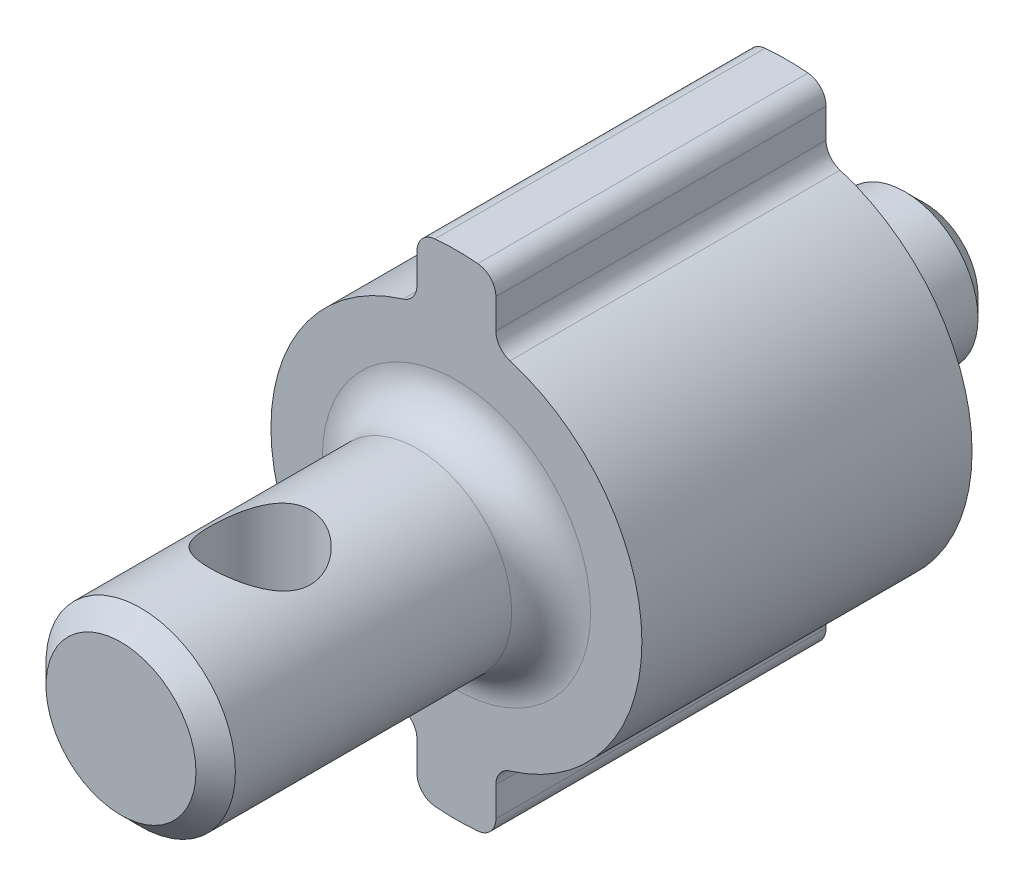
ISO-10303-21;
HEADER;
FILE_DESCRIPTION(('STEP AP214'),'2;1');
FILE_NAME('part.step','',(''),(''),'','','');
FILE_SCHEMA(('AUTOMOTIVE_DESIGN { 1 0 10303 214 1 1 1 1 }'));
ENDSEC;
DATA;
#1=APPLICATION_CONTEXT('core data for automotive mechanical design processes');
#2=APPLICATION_PROTOCOL_DEFINITION('international standard','automotive_design',2000,#1);
#3=PRODUCT_CONTEXT('',#1,'mechanical');
#4=PRODUCT('Part','Part','',(#3));
#5=PRODUCT_RELATED_PRODUCT_CATEGORY('part','',(#4));
#6=PRODUCT_DEFINITION_FORMATION('','',#4);
#7=PRODUCT_DEFINITION_CONTEXT('part definition',#1,'design');
#8=PRODUCT_DEFINITION('design','',#6,#7);
#9=PRODUCT_DEFINITION_SHAPE('','',#8);
#10=(LENGTH_UNIT() NAMED_UNIT(*) SI_UNIT(.MILLI.,.METRE.));
#11=(NAMED_UNIT(*) PLANE_ANGLE_UNIT() SI_UNIT($,.RADIAN.));
#12=(NAMED_UNIT(*) SI_UNIT($,.STERADIAN.) SOLID_ANGLE_UNIT());
#13=UNCERTAINTY_MEASURE_WITH_UNIT(LENGTH_MEASURE(1.E-05),#10,'distance_accuracy_value','');
#14=(GEOMETRIC_REPRESENTATION_CONTEXT(3) GLOBAL_UNCERTAINTY_ASSIGNED_CONTEXT((#13)) GLOBAL_UNIT_ASSIGNED_CONTEXT((#10,
#11,#12)) REPRESENTATION_CONTEXT('',''));
#15=CARTESIAN_POINT('',(0.,0.,0.));
#16=DIRECTION('',(0.,0.,1.));
#17=DIRECTION('',(1.,0.,0.));
#18=AXIS2_PLACEMENT_3D('',#15,#16,#17);
#19=CARTESIAN_POINT('',(0.,0.,11.8666666666667));
#20=DIRECTION('',(0.,0.,-1.));
#21=DIRECTION('',(-1.,0.,0.));
#22=AXIS2_PLACEMENT_3D('',#19,#20,#21);
#23=CYLINDRICAL_SURFACE('',#22,4.7);
#24=CARTESIAN_POINT('',(0.,0.,11.8666666666667));
#25=DIRECTION('',(0.,0.,1.));
#26=DIRECTION('',(1.,0.,0.));
#27=AXIS2_PLACEMENT_3D('',#24,#25,#26);
#28=CIRCLE('',#27,4.7);
#29=CARTESIAN_POINT('',(1.35576923076923,-4.50020997209013,11.8666666666667));
#30=VERTEX_POINT('',#29);
#31=CARTESIAN_POINT('',(1.35576923076923,4.50020997209013,11.8666666666667));
#32=VERTEX_POINT('',#31);
#33=EDGE_CURVE('E481',#30,#32,#28,.T.);
#34=ORIENTED_EDGE('',*,*,#33,.F.);
#35=DIRECTION('',(0.,0.,-1.));
#36=VECTOR('',#35,1.);
#37=CARTESIAN_POINT('',(1.35576923076923,-4.50020997209013,11.8666666666667));
#38=LINE('',#37,#36);
#39=CARTESIAN_POINT('',(1.35576923076923,-4.50020997209013,3.5));
#40=VERTEX_POINT('',#39);
#41=EDGE_CURVE('E256',#30,#40,#38,.T.);
#42=ORIENTED_EDGE('',*,*,#41,.T.);
#43=CARTESIAN_POINT('',(0.,0.,3.5));
#44=DIRECTION('',(0.,0.,-1.));
#45=DIRECTION('',(-1.,0.,0.));
#46=AXIS2_PLACEMENT_3D('',#43,#44,#45);
#47=CIRCLE('',#46,4.7);
#48=CARTESIAN_POINT('',(1.35576923076923,4.50020997209013,3.5));
#49=VERTEX_POINT('',#48);
#50=EDGE_CURVE('E198',#49,#40,#47,.T.);
#51=ORIENTED_EDGE('',*,*,#50,.F.);
#52=DIRECTION('',(0.,0.,-1.));
#53=VECTOR('',#52,1.);
#54=CARTESIAN_POINT('',(1.35576923076923,4.50020997209013,11.8666666666667));
#55=LINE('',#54,#53);
#56=EDGE_CURVE('E252',#49,#32,#55,.F.);
#57=ORIENTED_EDGE('',*,*,#56,.T.);
#58=EDGE_LOOP('',(#34,#42,#51,#57));
#59=FACE_BOUND('',#58,.T.);
#60=ADVANCED_FACE('F50',(#59),#23,.T.);
#61=CARTESIAN_POINT('',(-1.35576923076923,-4.50020997209013,3.5));
#62=VERTEX_POINT('',#61);
#63=CARTESIAN_POINT('',(-1.35576923076923,4.50020997209013,3.5));
#64=VERTEX_POINT('',#63);
#65=EDGE_CURVE('E178',#62,#64,#47,.T.);
#66=ORIENTED_EDGE('',*,*,#65,.F.);
#67=DIRECTION('',(0.,0.,-1.));
#68=VECTOR('',#67,1.);
#69=CARTESIAN_POINT('',(-1.35576923076923,-4.50020997209013,11.8666666666667));
#70=LINE('',#69,#68);
#71=CARTESIAN_POINT('',(-1.35576923076923,-4.50020997209013,11.8666666666667));
#72=VERTEX_POINT('',#71);
#73=EDGE_CURVE('E193',#62,#72,#70,.F.);
#74=ORIENTED_EDGE('',*,*,#73,.T.);
#75=CARTESIAN_POINT('',(-1.35576923076923,4.50020997209013,11.8666666666667));
#76=VERTEX_POINT('',#75);
#77=EDGE_CURVE('E210',#76,#72,#28,.T.);
#78=ORIENTED_EDGE('',*,*,#77,.F.);
#79=DIRECTION('',(0.,0.,-1.));
#80=VECTOR('',#79,1.);
#81=CARTESIAN_POINT('',(-1.35576923076923,4.50020997209013,11.8666666666667));
#82=LINE('',#81,#80);
#83=EDGE_CURVE('E196',#76,#64,#82,.T.);
#84=ORIENTED_EDGE('',*,*,#83,.T.);
#85=EDGE_LOOP('',(#66,#74,#78,#84));
#86=FACE_BOUND('',#85,.T.);
#87=ADVANCED_FACE('F191',(#86),#23,.T.);
#88=CARTESIAN_POINT('',(0.,0.,11.8666666666667));
#89=DIRECTION('',(0.,0.,1.));
#90=DIRECTION('',(1.,0.,0.));
#91=AXIS2_PLACEMENT_3D('',#88,#89,#90);
#92=PLANE('',#91);
#93=CARTESIAN_POINT('',(0.,0.,11.8666666666667));
#94=DIRECTION('',(0.,0.,1.));
#95=DIRECTION('',(1.,0.,0.));
#96=AXIS2_PLACEMENT_3D('',#93,#94,#95);
#97=CIRCLE('',#96,3.4);
#98=CARTESIAN_POINT('',(3.4,0.,11.8666666666667));
#99=VERTEX_POINT('',#98);
#100=EDGE_CURVE('E310',#99,#99,#97,.F.);
#101=ORIENTED_EDGE('',*,*,#100,.T.);
#102=EDGE_LOOP('',(#101));
#103=FACE_BOUND('',#102,.T.);
#104=DIRECTION('',(0.,-1.,0.));
#105=VECTOR('',#104,1.);
#106=CARTESIAN_POINT('',(-0.999999999999999,0.,11.8666666666667));
#107=LINE('',#106,#105);
#108=CARTESIAN_POINT('',(-1.,-4.97895571380184,11.8666666666667));
#109=VERTEX_POINT('',#108);
#110=CARTESIAN_POINT('',(-1.,-5.7282196186948,11.8666666666667));
#111=VERTEX_POINT('',#110);
#112=EDGE_CURVE('E437',#109,#111,#107,.T.);
#113=ORIENTED_EDGE('',*,*,#112,.T.);
#114=CARTESIAN_POINT('',(-0.5,-5.7282196186948,11.8666666666667));
#115=DIRECTION('',(0.,0.,1.));
#116=DIRECTION('',(1.,0.,0.));
#117=AXIS2_PLACEMENT_3D('',#114,#115,#116);
#118=CIRCLE('',#117,0.5);
#119=CARTESIAN_POINT('',(-0.543478260869565,-6.22632567249435,11.8666666666667));
#120=VERTEX_POINT('',#119);
#121=EDGE_CURVE('E224',#111,#120,#118,.T.);
#122=ORIENTED_EDGE('',*,*,#121,.T.);
#123=CARTESIAN_POINT('',(0.,0.,11.8666666666667));
#124=DIRECTION('',(0.,0.,1.));
#125=DIRECTION('',(1.,0.,0.));
#126=AXIS2_PLACEMENT_3D('',#123,#124,#125);
#127=CIRCLE('',#126,6.25);
#128=CARTESIAN_POINT('',(0.543478260869566,-6.22632567249435,11.8666666666667));
#129=VERTEX_POINT('',#128);
#130=EDGE_CURVE('E442',#120,#129,#127,.T.);
#131=ORIENTED_EDGE('',*,*,#130,.T.);
#132=CARTESIAN_POINT('',(0.5,-5.7282196186948,11.8666666666667));
#133=DIRECTION('',(0.,0.,1.));
#134=DIRECTION('',(1.,0.,0.));
#135=AXIS2_PLACEMENT_3D('',#132,#133,#134);
#136=CIRCLE('',#135,0.5);
#137=CARTESIAN_POINT('',(1.,-5.7282196186948,11.8666666666667));
#138=VERTEX_POINT('',#137);
#139=EDGE_CURVE('E221',#129,#138,#136,.T.);
#140=ORIENTED_EDGE('',*,*,#139,.T.);
#141=DIRECTION('',(0.,-1.,0.));
#142=VECTOR('',#141,1.);
#143=CARTESIAN_POINT('',(1.,0.,11.8666666666667));
#144=LINE('',#143,#142);
#145=CARTESIAN_POINT('',(1.,-4.97895571380184,11.8666666666667));
#146=VERTEX_POINT('',#145);
#147=EDGE_CURVE('E456',#146,#138,#144,.T.);
#148=ORIENTED_EDGE('',*,*,#147,.F.);
#149=CARTESIAN_POINT('',(1.5,-4.97895571380184,11.8666666666667));
#150=DIRECTION('',(0.,0.,1.));
#151=DIRECTION('',(1.,0.,0.));
#152=AXIS2_PLACEMENT_3D('',#149,#150,#151);
#153=CIRCLE('',#152,0.5);
#154=EDGE_CURVE('E186',#146,#30,#153,.F.);
#155=ORIENTED_EDGE('',*,*,#154,.T.);
#156=ORIENTED_EDGE('',*,*,#33,.T.);
#157=CARTESIAN_POINT('',(1.5,4.97895571380184,11.8666666666667));
#158=DIRECTION('',(0.,0.,1.));
#159=DIRECTION('',(1.,0.,0.));
#160=AXIS2_PLACEMENT_3D('',#157,#158,#159);
#161=CIRCLE('',#160,0.5);
#162=CARTESIAN_POINT('',(1.,4.97895571380184,11.8666666666667));
#163=VERTEX_POINT('',#162);
#164=EDGE_CURVE('E292',#32,#163,#161,.F.);
#165=ORIENTED_EDGE('',*,*,#164,.T.);
#166=DIRECTION('',(0.,1.,0.));
#167=VECTOR('',#166,1.);
#168=CARTESIAN_POINT('',(1.,0.,11.8666666666667));
#169=LINE('',#168,#167);
#170=CARTESIAN_POINT('',(1.,5.7282196186948,11.8666666666667));
#171=VERTEX_POINT('',#170);
#172=EDGE_CURVE('E469',#163,#171,#169,.T.);
#173=ORIENTED_EDGE('',*,*,#172,.T.);
#174=CARTESIAN_POINT('',(0.5,5.7282196186948,11.8666666666667));
#175=DIRECTION('',(0.,0.,1.));
#176=DIRECTION('',(1.,0.,0.));
#177=AXIS2_PLACEMENT_3D('',#174,#175,#176);
#178=CIRCLE('',#177,0.5);
#179=CARTESIAN_POINT('',(0.543478260869566,6.22632567249435,11.8666666666667));
#180=VERTEX_POINT('',#179);
#181=EDGE_CURVE('E218',#171,#180,#178,.T.);
#182=ORIENTED_EDGE('',*,*,#181,.T.);
#183=CARTESIAN_POINT('',(0.,0.,11.8666666666667));
#184=DIRECTION('',(0.,0.,1.));
#185=DIRECTION('',(1.,0.,0.));
#186=AXIS2_PLACEMENT_3D('',#183,#184,#185);
#187=CIRCLE('',#186,6.25);
#188=CARTESIAN_POINT('',(-0.543478260869565,6.22632567249435,11.8666666666667));
#189=VERTEX_POINT('',#188);
#190=EDGE_CURVE('E465',#180,#189,#187,.T.);
#191=ORIENTED_EDGE('',*,*,#190,.T.);
#192=CARTESIAN_POINT('',(-0.5,5.7282196186948,11.8666666666667));
#193=DIRECTION('',(0.,0.,1.));
#194=DIRECTION('',(1.,0.,0.));
#195=AXIS2_PLACEMENT_3D('',#192,#193,#194);
#196=CIRCLE('',#195,0.5);
#197=CARTESIAN_POINT('',(-1.,5.7282196186948,11.8666666666667));
#198=VERTEX_POINT('',#197);
#199=EDGE_CURVE('E215',#189,#198,#196,.T.);
#200=ORIENTED_EDGE('',*,*,#199,.T.);
#201=DIRECTION('',(0.,1.,0.));
#202=VECTOR('',#201,1.);
#203=CARTESIAN_POINT('',(-0.999999999999999,0.,11.8666666666667));
#204=LINE('',#203,#202);
#205=CARTESIAN_POINT('',(-1.,4.97895571380184,11.8666666666667));
#206=VERTEX_POINT('',#205);
#207=EDGE_CURVE('E460',#206,#198,#204,.T.);
#208=ORIENTED_EDGE('',*,*,#207,.F.);
#209=CARTESIAN_POINT('',(-1.5,4.97895571380184,11.8666666666667));
#210=DIRECTION('',(0.,0.,1.));
#211=DIRECTION('',(1.,0.,0.));
#212=AXIS2_PLACEMENT_3D('',#209,#210,#211);
#213=CIRCLE('',#212,0.5);
#214=EDGE_CURVE('E286',#206,#76,#213,.F.);
#215=ORIENTED_EDGE('',*,*,#214,.T.);
#216=ORIENTED_EDGE('',*,*,#77,.T.);
#217=CARTESIAN_POINT('',(-1.5,-4.97895571380184,11.8666666666667));
#218=DIRECTION('',(0.,0.,1.));
#219=DIRECTION('',(1.,0.,0.));
#220=AXIS2_PLACEMENT_3D('',#217,#218,#219);
#221=CIRCLE('',#220,0.5);
#222=EDGE_CURVE('E187',#72,#109,#221,.F.);
#223=ORIENTED_EDGE('',*,*,#222,.T.);
#224=EDGE_LOOP('',(#113,#122,#131,#140,#148,#155,#156,#165,#173,#182,#191,#200,#208,#215,#216,#223));
#225=FACE_BOUND('',#224,.T.);
#226=ADVANCED_FACE('F360',(#103,#225),#92,.T.);
#227=CARTESIAN_POINT('',(0.,0.,3.5));
#228=DIRECTION('',(0.,0.,-1.));
#229=DIRECTION('',(-1.,0.,0.));
#230=AXIS2_PLACEMENT_3D('',#227,#228,#229);
#231=PLANE('',#230);
#232=CARTESIAN_POINT('',(0.,0.,3.5));
#233=DIRECTION('',(0.,0.,-1.));
#234=DIRECTION('',(-1.,0.,0.));
#235=AXIS2_PLACEMENT_3D('',#232,#233,#234);
#236=CIRCLE('',#235,2.35);
#237=CARTESIAN_POINT('',(-2.35,0.,3.5));
#238=VERTEX_POINT('',#237);
#239=EDGE_CURVE('E302',#238,#238,#236,.F.);
#240=ORIENTED_EDGE('',*,*,#239,.T.);
#241=EDGE_LOOP('',(#240));
#242=FACE_BOUND('',#241,.T.);
#243=CARTESIAN_POINT('',(0.,0.,3.5));
#244=DIRECTION('',(0.,0.,-1.));
#245=DIRECTION('',(-1.,0.,0.));
#246=AXIS2_PLACEMENT_3D('',#243,#244,#245);
#247=CIRCLE('',#246,6.25);
#248=CARTESIAN_POINT('',(-0.543478260869565,-6.22632567249435,3.5));
#249=VERTEX_POINT('',#248);
#250=CARTESIAN_POINT('',(0.543478260869566,-6.22632567249435,3.5));
#251=VERTEX_POINT('',#250);
#252=EDGE_CURVE('E447',#249,#251,#247,.F.);
#253=ORIENTED_EDGE('',*,*,#252,.F.);
#254=CARTESIAN_POINT('',(-0.5,-5.7282196186948,3.5));
#255=DIRECTION('',(0.,0.,-1.));
#256=DIRECTION('',(-1.,0.,0.));
#257=AXIS2_PLACEMENT_3D('',#254,#255,#256);
#258=CIRCLE('',#257,0.5);
#259=CARTESIAN_POINT('',(-1.,-5.7282196186948,3.5));
#260=VERTEX_POINT('',#259);
#261=EDGE_CURVE('E242',#249,#260,#258,.T.);
#262=ORIENTED_EDGE('',*,*,#261,.T.);
#263=DIRECTION('',(0.,-1.,0.));
#264=VECTOR('',#263,1.);
#265=CARTESIAN_POINT('',(-0.999999999999999,0.,3.5));
#266=LINE('',#265,#264);
#267=CARTESIAN_POINT('',(-1.,-4.97895571380184,3.5));
#268=VERTEX_POINT('',#267);
#269=EDGE_CURVE('E181',#268,#260,#266,.T.);
#270=ORIENTED_EDGE('',*,*,#269,.F.);
#271=CARTESIAN_POINT('',(-1.5,-4.97895571380184,3.5));
#272=DIRECTION('',(0.,0.,-1.));
#273=DIRECTION('',(-1.,0.,0.));
#274=AXIS2_PLACEMENT_3D('',#271,#272,#273);
#275=CIRCLE('',#274,0.5);
#276=EDGE_CURVE('E174',#268,#62,#275,.F.);
#277=ORIENTED_EDGE('',*,*,#276,.T.);
#278=ORIENTED_EDGE('',*,*,#65,.T.);
#279=CARTESIAN_POINT('',(-1.5,4.97895571380184,3.5));
#280=DIRECTION('',(0.,0.,-1.));
#281=DIRECTION('',(-1.,0.,0.));
#282=AXIS2_PLACEMENT_3D('',#279,#280,#281);
#283=CIRCLE('',#282,0.5);
#284=CARTESIAN_POINT('',(-1.,4.97895571380184,3.5));
#285=VERTEX_POINT('',#284);
#286=EDGE_CURVE('E289',#64,#285,#283,.F.);
#287=ORIENTED_EDGE('',*,*,#286,.T.);
#288=DIRECTION('',(0.,1.,0.));
#289=VECTOR('',#288,1.);
#290=CARTESIAN_POINT('',(-0.999999999999999,0.,3.5));
#291=LINE('',#290,#289);
#292=CARTESIAN_POINT('',(-1.,5.7282196186948,3.5));
#293=VERTEX_POINT('',#292);
#294=EDGE_CURVE('E458',#285,#293,#291,.T.);
#295=ORIENTED_EDGE('',*,*,#294,.T.);
#296=CARTESIAN_POINT('',(-0.5,5.7282196186948,3.5));
#297=DIRECTION('',(0.,0.,-1.));
#298=DIRECTION('',(-1.,0.,0.));
#299=AXIS2_PLACEMENT_3D('',#296,#297,#298);
#300=CIRCLE('',#299,0.5);
#301=CARTESIAN_POINT('',(-0.543478260869565,6.22632567249435,3.5));
#302=VERTEX_POINT('',#301);
#303=EDGE_CURVE('E234',#293,#302,#300,.T.);
#304=ORIENTED_EDGE('',*,*,#303,.T.);
#305=CARTESIAN_POINT('',(0.,0.,3.5));
#306=DIRECTION('',(0.,0.,-1.));
#307=DIRECTION('',(-1.,0.,0.));
#308=AXIS2_PLACEMENT_3D('',#305,#306,#307);
#309=CIRCLE('',#308,6.25);
#310=CARTESIAN_POINT('',(0.543478260869566,6.22632567249435,3.5));
#311=VERTEX_POINT('',#310);
#312=EDGE_CURVE('E464',#311,#302,#309,.F.);
#313=ORIENTED_EDGE('',*,*,#312,.F.);
#314=CARTESIAN_POINT('',(0.5,5.7282196186948,3.5));
#315=DIRECTION('',(0.,0.,-1.));
#316=DIRECTION('',(-1.,0.,0.));
#317=AXIS2_PLACEMENT_3D('',#314,#315,#316);
#318=CIRCLE('',#317,0.5);
#319=CARTESIAN_POINT('',(1.,5.7282196186948,3.5));
#320=VERTEX_POINT('',#319);
#321=EDGE_CURVE('E74',#311,#320,#318,.T.);
#322=ORIENTED_EDGE('',*,*,#321,.T.);
#323=DIRECTION('',(0.,1.,0.));
#324=VECTOR('',#323,1.);
#325=CARTESIAN_POINT('',(1.,0.,3.5));
#326=LINE('',#325,#324);
#327=CARTESIAN_POINT('',(1.,4.97895571380184,3.5));
#328=VERTEX_POINT('',#327);
#329=EDGE_CURVE('E199',#328,#320,#326,.T.);
#330=ORIENTED_EDGE('',*,*,#329,.F.);
#331=CARTESIAN_POINT('',(1.5,4.97895571380184,3.5));
#332=DIRECTION('',(0.,0.,-1.));
#333=DIRECTION('',(-1.,0.,0.));
#334=AXIS2_PLACEMENT_3D('',#331,#332,#333);
#335=CIRCLE('',#334,0.5);
#336=EDGE_CURVE('E295',#328,#49,#335,.F.);
#337=ORIENTED_EDGE('',*,*,#336,.T.);
#338=ORIENTED_EDGE('',*,*,#50,.T.);
#339=CARTESIAN_POINT('',(1.5,-4.97895571380184,3.5));
#340=DIRECTION('',(0.,0.,-1.));
#341=DIRECTION('',(-1.,0.,0.));
#342=AXIS2_PLACEMENT_3D('',#339,#340,#341);
#343=CIRCLE('',#342,0.5);
#344=CARTESIAN_POINT('',(1.,-4.97895571380184,3.5));
#345=VERTEX_POINT('',#344);
#346=EDGE_CURVE('E283',#40,#345,#343,.F.);
#347=ORIENTED_EDGE('',*,*,#346,.T.);
#348=DIRECTION('',(0.,-1.,0.));
#349=VECTOR('',#348,1.);
#350=CARTESIAN_POINT('',(1.,0.,3.5));
#351=LINE('',#350,#349);
#352=CARTESIAN_POINT('',(1.,-5.7282196186948,3.5));
#353=VERTEX_POINT('',#352);
#354=EDGE_CURVE('E443',#345,#353,#351,.T.);
#355=ORIENTED_EDGE('',*,*,#354,.T.);
#356=CARTESIAN_POINT('',(0.5,-5.7282196186948,3.5));
#357=DIRECTION('',(0.,0.,-1.));
#358=DIRECTION('',(-1.,0.,0.));
#359=AXIS2_PLACEMENT_3D('',#356,#357,#358);
#360=CIRCLE('',#359,0.5);
#361=EDGE_CURVE('E239',#353,#251,#360,.T.);
#362=ORIENTED_EDGE('',*,*,#361,.T.);
#363=EDGE_LOOP('',(#253,#262,#270,#277,#278,#287,#295,#304,#313,#322,#330,#337,#338,#347,#355,#362));
#364=FACE_BOUND('',#363,.T.);
#365=ADVANCED_FACE('F177',(#242,#364),#231,.T.);
#366=CARTESIAN_POINT('',(0.,0.,3.5));
#367=DIRECTION('',(0.,0.,-1.));
#368=DIRECTION('',(-1.,0.,0.));
#369=AXIS2_PLACEMENT_3D('',#366,#367,#368);
#370=CYLINDRICAL_SURFACE('',#369,1.85);
#371=CARTESIAN_POINT('',(0.,0.,0.500000000000003));
#372=DIRECTION('',(0.,0.,1.));
#373=DIRECTION('',(1.,0.,0.));
#374=AXIS2_PLACEMENT_3D('',#371,#372,#373);
#375=CIRCLE('',#374,1.85);
#376=CARTESIAN_POINT('',(1.85,0.,0.500000000000003));
#377=VERTEX_POINT('',#376);
#378=EDGE_CURVE('E318',#377,#377,#375,.T.);
#379=ORIENTED_EDGE('',*,*,#378,.T.);
#380=EDGE_LOOP('',(#379));
#381=FACE_BOUND('',#380,.T.);
#382=CARTESIAN_POINT('',(0.,0.,3.));
#383=DIRECTION('',(0.,0.,-1.));
#384=DIRECTION('',(-1.,0.,0.));
#385=AXIS2_PLACEMENT_3D('',#382,#383,#384);
#386=CIRCLE('',#385,1.85);
#387=CARTESIAN_POINT('',(-1.85,0.,3.));
#388=VERTEX_POINT('',#387);
#389=EDGE_CURVE('E298',#388,#388,#386,.T.);
#390=ORIENTED_EDGE('',*,*,#389,.T.);
#391=EDGE_LOOP('',(#390));
#392=FACE_BOUND('',#391,.T.);
#393=ADVANCED_FACE('F412',(#381,#392),#370,.T.);
#394=CARTESIAN_POINT('',(0.,0.,0.));
#395=DIRECTION('',(0.,0.,1.));
#396=DIRECTION('',(1.,0.,0.));
#397=AXIS2_PLACEMENT_3D('',#394,#395,#396);
#398=PLANE('',#397);
#399=CARTESIAN_POINT('',(0.,0.,0.));
#400=DIRECTION('',(0.,0.,1.));
#401=DIRECTION('',(1.,0.,0.));
#402=AXIS2_PLACEMENT_3D('',#399,#400,#401);
#403=CIRCLE('',#402,1.35);
#404=CARTESIAN_POINT('',(1.35,0.,0.));
#405=VERTEX_POINT('',#404);
#406=EDGE_CURVE('E314',#405,#405,#403,.F.);
#407=ORIENTED_EDGE('',*,*,#406,.T.);
#408=EDGE_LOOP('',(#407));
#409=FACE_BOUND('',#408,.T.);
#410=ADVANCED_FACE('F364',(#409),#398,.F.);
#411=CARTESIAN_POINT('',(0.,0.,0.90236887068721));
#412=DIRECTION('',(0.,0.,1.));
#413=DIRECTION('',(1.,0.,0.));
#414=AXIS2_PLACEMENT_3D('',#411,#412,#413);
#415=CYLINDRICAL_SURFACE('',#414,6.25);
#416=ORIENTED_EDGE('',*,*,#190,.F.);
#417=DIRECTION('',(0.,0.,1.));
#418=VECTOR('',#417,1.);
#419=CARTESIAN_POINT('',(0.543478260869566,6.22632567249435,0.90236887068721));
#420=LINE('',#419,#418);
#421=EDGE_CURVE('E269',#180,#311,#420,.F.);
#422=ORIENTED_EDGE('',*,*,#421,.T.);
#423=ORIENTED_EDGE('',*,*,#312,.T.);
#424=DIRECTION('',(0.,0.,1.));
#425=VECTOR('',#424,1.);
#426=CARTESIAN_POINT('',(-0.543478260869565,6.22632567249435,0.90236887068721));
#427=LINE('',#426,#425);
#428=EDGE_CURVE('E265',#302,#189,#427,.T.);
#429=ORIENTED_EDGE('',*,*,#428,.T.);
#430=EDGE_LOOP('',(#416,#422,#423,#429));
#431=FACE_BOUND('',#430,.T.);
#432=ADVANCED_FACE('F411',(#431),#415,.T.);
#433=CARTESIAN_POINT('',(-0.999999999999999,0.,0.90236887068721));
#434=DIRECTION('',(1.,0.,0.));
#435=DIRECTION('',(0.,1.,0.));
#436=AXIS2_PLACEMENT_3D('',#433,#434,#435);
#437=PLANE('',#436);
#438=ORIENTED_EDGE('',*,*,#207,.T.);
#439=DIRECTION('',(0.,0.,-1.));
#440=VECTOR('',#439,1.);
#441=CARTESIAN_POINT('',(-1.,5.7282196186948,3.5));
#442=LINE('',#441,#440);
#443=EDGE_CURVE('E276',#198,#293,#442,.T.);
#444=ORIENTED_EDGE('',*,*,#443,.T.);
#445=ORIENTED_EDGE('',*,*,#294,.F.);
#446=DIRECTION('',(0.,0.,1.));
#447=VECTOR('',#446,1.);
#448=CARTESIAN_POINT('',(-1.,4.97895571380184,11.8666666666667));
#449=LINE('',#448,#447);
#450=EDGE_CURVE('E272',#285,#206,#449,.T.);
#451=ORIENTED_EDGE('',*,*,#450,.T.);
#452=EDGE_LOOP('',(#438,#444,#445,#451));
#453=FACE_BOUND('',#452,.T.);
#454=ADVANCED_FACE('F417',(#453),#437,.F.);
#455=CARTESIAN_POINT('',(1.,0.,0.90236887068721));
#456=DIRECTION('',(1.,0.,0.));
#457=DIRECTION('',(0.,1.,0.));
#458=AXIS2_PLACEMENT_3D('',#455,#456,#457);
#459=PLANE('',#458);
#460=ORIENTED_EDGE('',*,*,#329,.T.);
#461=DIRECTION('',(0.,0.,1.));
#462=VECTOR('',#461,1.);
#463=CARTESIAN_POINT('',(1.,5.7282196186948,0.90236887068721));
#464=LINE('',#463,#462);
#465=EDGE_CURVE('E261',#320,#171,#464,.T.);
#466=ORIENTED_EDGE('',*,*,#465,.T.);
#467=ORIENTED_EDGE('',*,*,#172,.F.);
#468=DIRECTION('',(0.,0.,-1.));
#469=VECTOR('',#468,1.);
#470=CARTESIAN_POINT('',(1.,4.97895571380184,0.90236887068721));
#471=LINE('',#470,#469);
#472=EDGE_CURVE('E81',#163,#328,#471,.T.);
#473=ORIENTED_EDGE('',*,*,#472,.T.);
#474=EDGE_LOOP('',(#460,#466,#467,#473));
#475=FACE_BOUND('',#474,.T.);
#476=ADVANCED_FACE('F514',(#475),#459,.T.);
#477=CARTESIAN_POINT('',(0.,0.,0.90236887068721));
#478=DIRECTION('',(0.,0.,1.));
#479=DIRECTION('',(1.,0.,0.));
#480=AXIS2_PLACEMENT_3D('',#477,#478,#479);
#481=CYLINDRICAL_SURFACE('',#480,6.25);
#482=ORIENTED_EDGE('',*,*,#130,.F.);
#483=DIRECTION('',(0.,0.,1.));
#484=VECTOR('',#483,1.);
#485=CARTESIAN_POINT('',(-0.543478260869565,-6.22632567249435,0.90236887068721));
#486=LINE('',#485,#484);
#487=EDGE_CURVE('E231',#120,#249,#486,.F.);
#488=ORIENTED_EDGE('',*,*,#487,.T.);
#489=ORIENTED_EDGE('',*,*,#252,.T.);
#490=DIRECTION('',(0.,0.,1.));
#491=VECTOR('',#490,1.);
#492=CARTESIAN_POINT('',(0.543478260869566,-6.22632567249435,0.90236887068721));
#493=LINE('',#492,#491);
#494=EDGE_CURVE('E227',#251,#129,#493,.T.);
#495=ORIENTED_EDGE('',*,*,#494,.T.);
#496=EDGE_LOOP('',(#482,#488,#489,#495));
#497=FACE_BOUND('',#496,.T.);
#498=ADVANCED_FACE('F502',(#497),#481,.T.);
#499=CARTESIAN_POINT('',(1.,0.,0.90236887068721));
#500=DIRECTION('',(-1.,0.,0.));
#501=DIRECTION('',(0.,-1.,0.));
#502=AXIS2_PLACEMENT_3D('',#499,#500,#501);
#503=PLANE('',#502);
#504=ORIENTED_EDGE('',*,*,#354,.F.);
#505=DIRECTION('',(0.,0.,1.));
#506=VECTOR('',#505,1.);
#507=CARTESIAN_POINT('',(1.,-4.97895571380184,11.8666666666667));
#508=LINE('',#507,#506);
#509=EDGE_CURVE('E248',#345,#146,#508,.T.);
#510=ORIENTED_EDGE('',*,*,#509,.T.);
#511=ORIENTED_EDGE('',*,*,#147,.T.);
#512=DIRECTION('',(0.,0.,-1.));
#513=VECTOR('',#512,1.);
#514=CARTESIAN_POINT('',(1.,-5.7282196186948,3.5));
#515=LINE('',#514,#513);
#516=EDGE_CURVE('E245',#138,#353,#515,.T.);
#517=ORIENTED_EDGE('',*,*,#516,.T.);
#518=EDGE_LOOP('',(#504,#510,#511,#517));
#519=FACE_BOUND('',#518,.T.);
#520=ADVANCED_FACE('F496',(#519),#503,.F.);
#521=CARTESIAN_POINT('',(-0.999999999999999,0.,0.90236887068721));
#522=DIRECTION('',(-1.,0.,0.));
#523=DIRECTION('',(0.,-1.,0.));
#524=AXIS2_PLACEMENT_3D('',#521,#522,#523);
#525=PLANE('',#524);
#526=ORIENTED_EDGE('',*,*,#112,.F.);
#527=DIRECTION('',(0.,0.,-1.));
#528=VECTOR('',#527,1.);
#529=CARTESIAN_POINT('',(-1.,-4.97895571380184,0.90236887068721));
#530=LINE('',#529,#528);
#531=EDGE_CURVE('E208',#109,#268,#530,.T.);
#532=ORIENTED_EDGE('',*,*,#531,.T.);
#533=ORIENTED_EDGE('',*,*,#269,.T.);
#534=DIRECTION('',(0.,0.,1.));
#535=VECTOR('',#534,1.);
#536=CARTESIAN_POINT('',(-1.,-5.7282196186948,0.90236887068721));
#537=LINE('',#536,#535);
#538=EDGE_CURVE('E203',#260,#111,#537,.T.);
#539=ORIENTED_EDGE('',*,*,#538,.T.);
#540=EDGE_LOOP('',(#526,#532,#533,#539));
#541=FACE_BOUND('',#540,.T.);
#542=ADVANCED_FACE('F369',(#541),#525,.T.);
#543=CARTESIAN_POINT('',(-1.5,-4.97895571380184,11.8666666666667));
#544=DIRECTION('',(0.,0.,-1.));
#545=DIRECTION('',(-1.,0.,0.));
#546=AXIS2_PLACEMENT_3D('',#543,#544,#545);
#547=CYLINDRICAL_SURFACE('',#546,0.5);
#548=ORIENTED_EDGE('',*,*,#276,.F.);
#549=ORIENTED_EDGE('',*,*,#531,.F.);
#550=ORIENTED_EDGE('',*,*,#222,.F.);
#551=ORIENTED_EDGE('',*,*,#73,.F.);
#552=EDGE_LOOP('',(#548,#549,#550,#551));
#553=FACE_BOUND('',#552,.T.);
#554=ADVANCED_FACE('F201',(#553),#547,.F.);
#555=CARTESIAN_POINT('',(-0.5,-5.7282196186948,0.90236887068721));
#556=DIRECTION('',(0.,0.,1.));
#557=DIRECTION('',(1.,0.,0.));
#558=AXIS2_PLACEMENT_3D('',#555,#556,#557);
#559=CYLINDRICAL_SURFACE('',#558,0.5);
#560=ORIENTED_EDGE('',*,*,#261,.F.);
#561=ORIENTED_EDGE('',*,*,#487,.F.);
#562=ORIENTED_EDGE('',*,*,#121,.F.);
#563=ORIENTED_EDGE('',*,*,#538,.F.);
#564=EDGE_LOOP('',(#560,#561,#562,#563));
#565=FACE_BOUND('',#564,.T.);
#566=ADVANCED_FACE('F368',(#565),#559,.T.);
#567=CARTESIAN_POINT('',(1.5,-4.97895571380184,11.8666666666667));
#568=DIRECTION('',(0.,0.,-1.));
#569=DIRECTION('',(-1.,0.,0.));
#570=AXIS2_PLACEMENT_3D('',#567,#568,#569);
#571=CYLINDRICAL_SURFACE('',#570,0.5);
#572=ORIENTED_EDGE('',*,*,#346,.F.);
#573=ORIENTED_EDGE('',*,*,#41,.F.);
#574=ORIENTED_EDGE('',*,*,#154,.F.);
#575=ORIENTED_EDGE('',*,*,#509,.F.);
#576=EDGE_LOOP('',(#572,#573,#574,#575));
#577=FACE_BOUND('',#576,.T.);
#578=ADVANCED_FACE('F372',(#577),#571,.F.);
#579=CARTESIAN_POINT('',(0.5,-5.7282196186948,0.90236887068721));
#580=DIRECTION('',(0.,0.,1.));
#581=DIRECTION('',(1.,0.,0.));
#582=AXIS2_PLACEMENT_3D('',#579,#580,#581);
#583=CYLINDRICAL_SURFACE('',#582,0.5);
#584=ORIENTED_EDGE('',*,*,#361,.F.);
#585=ORIENTED_EDGE('',*,*,#516,.F.);
#586=ORIENTED_EDGE('',*,*,#139,.F.);
#587=ORIENTED_EDGE('',*,*,#494,.F.);
#588=EDGE_LOOP('',(#584,#585,#586,#587));
#589=FACE_BOUND('',#588,.T.);
#590=ADVANCED_FACE('F376',(#589),#583,.T.);
#591=CARTESIAN_POINT('',(0.5,5.7282196186948,0.90236887068721));
#592=DIRECTION('',(0.,0.,1.));
#593=DIRECTION('',(1.,0.,0.));
#594=AXIS2_PLACEMENT_3D('',#591,#592,#593);
#595=CYLINDRICAL_SURFACE('',#594,0.5);
#596=ORIENTED_EDGE('',*,*,#321,.F.);
#597=ORIENTED_EDGE('',*,*,#421,.F.);
#598=ORIENTED_EDGE('',*,*,#181,.F.);
#599=ORIENTED_EDGE('',*,*,#465,.F.);
#600=EDGE_LOOP('',(#596,#597,#598,#599));
#601=FACE_BOUND('',#600,.T.);
#602=ADVANCED_FACE('F380',(#601),#595,.T.);
#603=CARTESIAN_POINT('',(-0.5,5.7282196186948,0.90236887068721));
#604=DIRECTION('',(0.,0.,1.));
#605=DIRECTION('',(1.,0.,0.));
#606=AXIS2_PLACEMENT_3D('',#603,#604,#605);
#607=CYLINDRICAL_SURFACE('',#606,0.5);
#608=ORIENTED_EDGE('',*,*,#303,.F.);
#609=ORIENTED_EDGE('',*,*,#443,.F.);
#610=ORIENTED_EDGE('',*,*,#199,.F.);
#611=ORIENTED_EDGE('',*,*,#428,.F.);
#612=EDGE_LOOP('',(#608,#609,#610,#611));
#613=FACE_BOUND('',#612,.T.);
#614=ADVANCED_FACE('F384',(#613),#607,.T.);
#615=CARTESIAN_POINT('',(-1.5,4.97895571380184,11.8666666666667));
#616=DIRECTION('',(0.,0.,-1.));
#617=DIRECTION('',(-1.,0.,0.));
#618=AXIS2_PLACEMENT_3D('',#615,#616,#617);
#619=CYLINDRICAL_SURFACE('',#618,0.5);
#620=ORIENTED_EDGE('',*,*,#286,.F.);
#621=ORIENTED_EDGE('',*,*,#83,.F.);
#622=ORIENTED_EDGE('',*,*,#214,.F.);
#623=ORIENTED_EDGE('',*,*,#450,.F.);
#624=EDGE_LOOP('',(#620,#621,#622,#623));
#625=FACE_BOUND('',#624,.T.);
#626=ADVANCED_FACE('F388',(#625),#619,.F.);
#627=CARTESIAN_POINT('',(1.5,4.97895571380184,11.8666666666667));
#628=DIRECTION('',(0.,0.,-1.));
#629=DIRECTION('',(-1.,0.,0.));
#630=AXIS2_PLACEMENT_3D('',#627,#628,#629);
#631=CYLINDRICAL_SURFACE('',#630,0.5);
#632=ORIENTED_EDGE('',*,*,#336,.F.);
#633=ORIENTED_EDGE('',*,*,#472,.F.);
#634=ORIENTED_EDGE('',*,*,#164,.F.);
#635=ORIENTED_EDGE('',*,*,#56,.F.);
#636=EDGE_LOOP('',(#632,#633,#634,#635));
#637=FACE_BOUND('',#636,.T.);
#638=ADVANCED_FACE('F392',(#637),#631,.F.);
#639=CARTESIAN_POINT('',(0.,0.,3.));
#640=DIRECTION('',(0.,0.,-1.));
#641=DIRECTION('',(-1.,0.,0.));
#642=AXIS2_PLACEMENT_3D('',#639,#640,#641);
#643=TOROIDAL_SURFACE('',#642,2.35,0.5);
#644=ORIENTED_EDGE('',*,*,#239,.F.);
#645=EDGE_LOOP('',(#644));
#646=FACE_BOUND('',#645,.T.);
#647=ORIENTED_EDGE('',*,*,#389,.F.);
#648=EDGE_LOOP('',(#647));
#649=FACE_BOUND('',#648,.T.);
#650=ADVANCED_FACE('F352',(#646,#649),#643,.F.);
#651=CARTESIAN_POINT('',(0.,0.,20.3666666666667));
#652=DIRECTION('',(0.,0.,-1.));
#653=DIRECTION('',(-1.,0.,0.));
#654=AXIS2_PLACEMENT_3D('',#651,#652,#653);
#655=CYLINDRICAL_SURFACE('',#654,2.4);
#656=CARTESIAN_POINT('',(0.,-2.4,18.1166666666667));
#657=CARTESIAN_POINT('',(0.0665165812293413,-2.39999614814082,18.116662341681));
#658=CARTESIAN_POINT('',(0.133096888980421,-2.39720596610639,18.1114311066639));
#659=CARTESIAN_POINT('',(0.264257399720477,-2.38631884532829,18.0907530776992));
#660=CARTESIAN_POINT('',(0.328834292445117,-2.37821356749963,18.0752902305849));
#661=CARTESIAN_POINT('',(0.453897443929675,-2.35753675128897,18.0349405242683));
#662=CARTESIAN_POINT('',(0.514399074173392,-2.34498326111928,18.010091721222));
#663=CARTESIAN_POINT('',(0.630266260759359,-2.31653379572523,17.9518906133837));
#664=CARTESIAN_POINT('',(0.68563181929919,-2.30063782193104,17.9185383122302));
#665=CARTESIAN_POINT('',(0.793748513543444,-2.2657006341582,17.841800491654));
#666=CARTESIAN_POINT('',(0.846088400696375,-2.24652133976784,17.7978994713677));
#667=CARTESIAN_POINT('',(0.943048513485135,-2.20757667349304,17.7024338925309));
#668=CARTESIAN_POINT('',(0.98766203576159,-2.18781080994429,17.6508627507982));
#669=CARTESIAN_POINT('',(1.07196272341101,-2.14785084663678,17.5359610127764));
#670=CARTESIAN_POINT('',(1.11084105270652,-2.12777929898857,17.4719890151773));
#671=CARTESIAN_POINT('',(1.17712891088919,-2.09184076058949,17.3372632596857));
#672=CARTESIAN_POINT('',(1.20454726966649,-2.07597053619502,17.266514774924));
#673=CARTESIAN_POINT('',(1.24523935964415,-2.05180691629878,17.1246806584174));
#674=CARTESIAN_POINT('',(1.25928898583626,-2.04310250547608,17.0538915685432));
#675=CARTESIAN_POINT('',(1.27517773939821,-2.03322898146489,16.9104728217306));
#676=CARTESIAN_POINT('',(1.27703205176211,-2.0320504974223,16.8378455668016));
#677=CARTESIAN_POINT('',(1.26904375400522,-2.03704061953005,16.7037292924756));
#678=CARTESIAN_POINT('',(1.26079475074545,-2.04220851360619,16.642098180584));
#679=CARTESIAN_POINT('',(1.23563099623993,-2.0575303191698,16.5212750669701));
#680=CARTESIAN_POINT('',(1.21871281133909,-2.06768620621553,16.4620840417519));
#681=CARTESIAN_POINT('',(1.17642808525538,-2.09203736038524,16.3461480643098));
#682=CARTESIAN_POINT('',(1.15087960677134,-2.10631856512566,16.2894883896573));
#683=CARTESIAN_POINT('',(1.09220851270077,-2.13733029969295,16.1809740965808));
#684=CARTESIAN_POINT('',(1.05908253313059,-2.15406191617417,16.1291216266957));
#685=CARTESIAN_POINT('',(0.980587222950939,-2.19102507654989,16.0237455798537));
#686=CARTESIAN_POINT('',(0.934137462744944,-2.21141148533505,15.9710781732742));
#687=CARTESIAN_POINT('',(0.833046825003414,-2.25144182833074,15.8738972798015));
#688=CARTESIAN_POINT('',(0.778401057342821,-2.27108531045493,15.8293886963183));
#689=CARTESIAN_POINT('',(0.658452537733861,-2.30881249188167,15.7472960365472));
#690=CARTESIAN_POINT('',(0.592712670238625,-2.32673708963397,15.7102713420082));
#691=CARTESIAN_POINT('',(0.454750374768109,-2.35757942385613,15.6481273273182));
#692=CARTESIAN_POINT('',(0.382533761200251,-2.37050159684905,15.6229974535275));
#693=CARTESIAN_POINT('',(0.2405832794761,-2.38888592056118,15.5876305080999));
#694=CARTESIAN_POINT('',(0.171205290811453,-2.39491204219727,15.5762622134609));
#695=CARTESIAN_POINT('',(0.0312784612111556,-2.4008152584313,15.5651229813959));
#696=CARTESIAN_POINT('',(-0.0392696879931352,-2.40069586488402,15.5653454204457));
#697=CARTESIAN_POINT('',(-0.172768636471538,-2.3946223862634,15.5768113893887));
#698=CARTESIAN_POINT('',(-0.235832523716208,-2.38919350877607,15.5870628847745));
#699=CARTESIAN_POINT('',(-0.359194786063062,-2.37378271425166,15.6166651370441));
#700=CARTESIAN_POINT('',(-0.419492871728479,-2.36380032188738,15.6360168438771));
#701=CARTESIAN_POINT('',(-0.537406111028007,-2.33985216908652,15.6836652931624));
#702=CARTESIAN_POINT('',(-0.594915286281438,-2.32579232029116,15.7121752683511));
#703=CARTESIAN_POINT('',(-0.704501079774349,-2.29497786569938,15.7770712136751));
#704=CARTESIAN_POINT('',(-0.756575550824262,-2.27822220141216,15.8134602794221));
#705=CARTESIAN_POINT('',(-0.859746853816023,-2.24146060056221,15.8975526683849));
#706=CARTESIAN_POINT('',(-0.910141432178332,-2.22129876068736,15.9460504186209));
#707=CARTESIAN_POINT('',(-1.0024361059272,-2.18120588786224,16.0507043753028));
#708=CARTESIAN_POINT('',(-1.044328457173,-2.16127508078352,16.1068674864738));
#709=CARTESIAN_POINT('',(-1.12110981582708,-2.12251819073786,16.229841108497));
#710=CARTESIAN_POINT('',(-1.15535332544371,-2.10385207485008,16.2971099058237));
#711=CARTESIAN_POINT('',(-1.21168311840585,-2.07192790447902,16.4377306635505));
#712=CARTESIAN_POINT('',(-1.23378663958105,-2.05866218881947,16.5110738275253));
#713=CARTESIAN_POINT('',(-1.26303434753679,-2.0408362107621,16.6541457845914));
#714=CARTESIAN_POINT('',(-1.27143188828366,-2.0355504353816,16.7235247815162));
#715=CARTESIAN_POINT('',(-1.27672508913701,-2.03223717112164,16.8628754336176));
#716=CARTESIAN_POINT('',(-1.27362836885625,-2.03420487386323,16.9328466655104));
#717=CARTESIAN_POINT('',(-1.25722588476567,-2.0443710366392,17.0624853333313));
#718=CARTESIAN_POINT('',(-1.24518763904029,-2.05179479278612,17.1223829161501));
#719=CARTESIAN_POINT('',(-1.21295724749816,-2.07101052826458,17.2392009004799));
#720=CARTESIAN_POINT('',(-1.19276211161892,-2.082804109307,17.2961202015934));
#721=CARTESIAN_POINT('',(-1.14336217723086,-2.11034815735909,17.4094844582383));
#722=CARTESIAN_POINT('',(-1.11365882089793,-2.12630533099767,17.4656602442723));
#723=CARTESIAN_POINT('',(-1.04658526139395,-2.16010873027077,17.5726068547447));
#724=CARTESIAN_POINT('',(-1.00921092913537,-2.17795597076452,17.6233747458042));
#725=CARTESIAN_POINT('',(-0.921609883456206,-2.21658279179928,17.7256450881192));
#726=CARTESIAN_POINT('',(-0.870309219930832,-2.23741640884437,17.7762123364972));
#727=CARTESIAN_POINT('',(-0.759500579470721,-2.27741692465712,17.868299218424));
#728=CARTESIAN_POINT('',(-0.699987395169124,-2.29658275324573,17.9098130679844));
#729=CARTESIAN_POINT('',(-0.57249270740871,-2.33167788782412,17.9833386128036));
#730=CARTESIAN_POINT('',(-0.504347863012882,-2.34752257764699,18.0151096939831));
#731=CARTESIAN_POINT('',(-0.362651806095134,-2.37352727961348,18.0663086512394));
#732=CARTESIAN_POINT('',(-0.289115694701488,-2.3837025318201,18.0857696374476));
#733=CARTESIAN_POINT('',(-0.178938857390988,-2.3935850208486,18.1045582070205));
#734=CARTESIAN_POINT('',(-0.143352249639035,-2.39598243309093,18.1090904522488));
#735=CARTESIAN_POINT('',(-0.0718499638646417,-2.39919097434167,18.1151458716175));
#736=CARTESIAN_POINT('',(-0.0359342811904673,-2.40000208089153,18.1166690031555));
#737=CARTESIAN_POINT('',(0.,-2.4,18.1166666666667));
#738=B_SPLINE_CURVE_WITH_KNOTS('',3,(#656,#657,#658,#659,#660,#661,#662,#663,#664,#665,#666,
#667,#668,#669,#670,#671,#672,#673,#674,#675,#676,#677,#678,#679,#680,#681,#682,#683,#684,#685,
#686,#687,#688,#689,#690,#691,#692,#693,#694,#695,#696,#697,#698,#699,#700,#701,#702,#703,#704,
#705,#706,#707,#708,#709,#710,#711,#712,#713,#714,#715,#716,#717,#718,#719,#720,#721,#722,#723,
#724,#725,#726,#727,#728,#729,#730,#731,#732,#733,#734,#735,#736,#737),.UNSPECIFIED.,.T.,.F.,(4,
2,2,2,2,2,2,2,2,2,2,2,2,2,2,2,2,2,2,2,2,2,2,2,2,2,2,2,2,2,2,2,2,2,2,2,2,2,2,2,4),(0.,
0.199404706670731,0.399123019002871,0.598040100638411,0.7969570971625,1.00895291596314,
1.22113174986798,1.45247365584404,1.68363698316356,1.90037505616665,2.1168432065984,
2.30315332527716,2.48953729403332,2.68012494414988,2.87079736922179,3.0892351693166,
3.30780382203083,3.53919436542041,3.77037922170626,3.98088162246688,4.19126373296193,
4.38274312989896,4.57424251934846,4.7705702632558,4.96697528268597,5.18441904976978,
5.40205999245134,5.63407902271933,5.86576774681851,6.07475922922314,6.28361219470431,
6.46744399483492,6.65134324323855,6.84714569860922,7.04305382708189,7.26700653747131,
7.49110190916002,7.72035351078427,7.94898584888683,8.05670881394283,8.16443330410421),.UNSPECIFIED.);
#739=CARTESIAN_POINT('',(0.,-2.4,18.1166666666667));
#740=VERTEX_POINT('',#739);
#741=EDGE_CURVE('E55',#740,#740,#738,.T.);
#742=ORIENTED_EDGE('',*,*,#741,.T.);
#743=EDGE_LOOP('',(#742));
#744=FACE_BOUND('',#743,.T.);
#745=CARTESIAN_POINT('',(0.,2.4,18.1166666666667));
#746=CARTESIAN_POINT('',(-0.0665165812293413,2.39999614814082,18.116662341681));
#747=CARTESIAN_POINT('',(-0.133096888980421,2.39720596610639,18.1114311066639));
#748=CARTESIAN_POINT('',(-0.264257399720477,2.38631884532829,18.0907530776992));
#749=CARTESIAN_POINT('',(-0.328834292445117,2.37821356749963,18.0752902305849));
#750=CARTESIAN_POINT('',(-0.453897443929675,2.35753675128897,18.0349405242683));
#751=CARTESIAN_POINT('',(-0.514399074173392,2.34498326111928,18.010091721222));
#752=CARTESIAN_POINT('',(-0.630266260759359,2.31653379572523,17.9518906133837));
#753=CARTESIAN_POINT('',(-0.68563181929919,2.30063782193104,17.9185383122302));
#754=CARTESIAN_POINT('',(-0.793748513543444,2.2657006341582,17.841800491654));
#755=CARTESIAN_POINT('',(-0.846088400696375,2.24652133976784,17.7978994713677));
#756=CARTESIAN_POINT('',(-0.943048513485135,2.20757667349304,17.7024338925309));
#757=CARTESIAN_POINT('',(-0.98766203576159,2.18781080994429,17.6508627507982));
#758=CARTESIAN_POINT('',(-1.07196272341101,2.14785084663678,17.5359610127764));
#759=CARTESIAN_POINT('',(-1.11084105270652,2.12777929898857,17.4719890151773));
#760=CARTESIAN_POINT('',(-1.17712891088919,2.09184076058949,17.3372632596857));
#761=CARTESIAN_POINT('',(-1.20454726966649,2.07597053619502,17.266514774924));
#762=CARTESIAN_POINT('',(-1.24523935964415,2.05180691629878,17.1246806584174));
#763=CARTESIAN_POINT('',(-1.25928898583626,2.04310250547608,17.0538915685432));
#764=CARTESIAN_POINT('',(-1.27517773939821,2.03322898146489,16.9104728217306));
#765=CARTESIAN_POINT('',(-1.27703205176211,2.0320504974223,16.8378455668016));
#766=CARTESIAN_POINT('',(-1.26904375400522,2.03704061953005,16.7037292924756));
#767=CARTESIAN_POINT('',(-1.26079475074545,2.04220851360619,16.642098180584));
#768=CARTESIAN_POINT('',(-1.23563099623993,2.0575303191698,16.5212750669701));
#769=CARTESIAN_POINT('',(-1.21871281133909,2.06768620621553,16.4620840417519));
#770=CARTESIAN_POINT('',(-1.17642808525538,2.09203736038524,16.3461480643098));
#771=CARTESIAN_POINT('',(-1.15087960677134,2.10631856512566,16.2894883896573));
#772=CARTESIAN_POINT('',(-1.09220851270077,2.13733029969295,16.1809740965808));
#773=CARTESIAN_POINT('',(-1.05908253313059,2.15406191617417,16.1291216266957));
#774=CARTESIAN_POINT('',(-0.980587222950939,2.19102507654989,16.0237455798537));
#775=CARTESIAN_POINT('',(-0.934137462744944,2.21141148533505,15.9710781732742));
#776=CARTESIAN_POINT('',(-0.833046825003414,2.25144182833074,15.8738972798015));
#777=CARTESIAN_POINT('',(-0.778401057342821,2.27108531045493,15.8293886963183));
#778=CARTESIAN_POINT('',(-0.658452537733861,2.30881249188167,15.7472960365472));
#779=CARTESIAN_POINT('',(-0.592712670238625,2.32673708963397,15.7102713420082));
#780=CARTESIAN_POINT('',(-0.454750374768109,2.35757942385613,15.6481273273182));
#781=CARTESIAN_POINT('',(-0.382533761200251,2.37050159684905,15.6229974535275));
#782=CARTESIAN_POINT('',(-0.2405832794761,2.38888592056118,15.5876305080999));
#783=CARTESIAN_POINT('',(-0.171205290811453,2.39491204219727,15.5762622134609));
#784=CARTESIAN_POINT('',(-0.0312784612111556,2.4008152584313,15.5651229813959));
#785=CARTESIAN_POINT('',(0.0392696879931352,2.40069586488402,15.5653454204457));
#786=CARTESIAN_POINT('',(0.172768636471538,2.3946223862634,15.5768113893887));
#787=CARTESIAN_POINT('',(0.235832523716208,2.38919350877607,15.5870628847745));
#788=CARTESIAN_POINT('',(0.359194786063062,2.37378271425166,15.6166651370441));
#789=CARTESIAN_POINT('',(0.419492871728479,2.36380032188738,15.6360168438771));
#790=CARTESIAN_POINT('',(0.537406111028007,2.33985216908652,15.6836652931624));
#791=CARTESIAN_POINT('',(0.594915286281438,2.32579232029116,15.7121752683511));
#792=CARTESIAN_POINT('',(0.704501079774349,2.29497786569938,15.7770712136751));
#793=CARTESIAN_POINT('',(0.756575550824262,2.27822220141216,15.8134602794221));
#794=CARTESIAN_POINT('',(0.859746853816023,2.24146060056221,15.8975526683849));
#795=CARTESIAN_POINT('',(0.910141432178332,2.22129876068736,15.9460504186209));
#796=CARTESIAN_POINT('',(1.0024361059272,2.18120588786224,16.0507043753028));
#797=CARTESIAN_POINT('',(1.044328457173,2.16127508078352,16.1068674864738));
#798=CARTESIAN_POINT('',(1.12110981582708,2.12251819073786,16.229841108497));
#799=CARTESIAN_POINT('',(1.15535332544371,2.10385207485008,16.2971099058237));
#800=CARTESIAN_POINT('',(1.21168311840585,2.07192790447902,16.4377306635505));
#801=CARTESIAN_POINT('',(1.23378663958105,2.05866218881947,16.5110738275253));
#802=CARTESIAN_POINT('',(1.26303434753679,2.0408362107621,16.6541457845914));
#803=CARTESIAN_POINT('',(1.27143188828366,2.0355504353816,16.7235247815162));
#804=CARTESIAN_POINT('',(1.27672508913701,2.03223717112164,16.8628754336176));
#805=CARTESIAN_POINT('',(1.27362836885625,2.03420487386323,16.9328466655104));
#806=CARTESIAN_POINT('',(1.25722588476567,2.0443710366392,17.0624853333313));
#807=CARTESIAN_POINT('',(1.24518763904029,2.05179479278612,17.1223829161501));
#808=CARTESIAN_POINT('',(1.21295724749816,2.07101052826458,17.2392009004799));
#809=CARTESIAN_POINT('',(1.19276211161892,2.082804109307,17.2961202015934));
#810=CARTESIAN_POINT('',(1.14336217723086,2.11034815735909,17.4094844582383));
#811=CARTESIAN_POINT('',(1.11365882089793,2.12630533099767,17.4656602442723));
#812=CARTESIAN_POINT('',(1.04658526139395,2.16010873027077,17.5726068547447));
#813=CARTESIAN_POINT('',(1.00921092913537,2.17795597076452,17.6233747458042));
#814=CARTESIAN_POINT('',(0.921609883456206,2.21658279179928,17.7256450881192));
#815=CARTESIAN_POINT('',(0.870309219930832,2.23741640884437,17.7762123364972));
#816=CARTESIAN_POINT('',(0.759500579470721,2.27741692465712,17.868299218424));
#817=CARTESIAN_POINT('',(0.699987395169124,2.29658275324573,17.9098130679844));
#818=CARTESIAN_POINT('',(0.57249270740871,2.33167788782412,17.9833386128036));
#819=CARTESIAN_POINT('',(0.504347863012882,2.34752257764699,18.0151096939831));
#820=CARTESIAN_POINT('',(0.362651806095134,2.37352727961348,18.0663086512394));
#821=CARTESIAN_POINT('',(0.289115694701488,2.3837025318201,18.0857696374476));
#822=CARTESIAN_POINT('',(0.178938857390988,2.3935850208486,18.1045582070205));
#823=CARTESIAN_POINT('',(0.143352249639035,2.39598243309093,18.1090904522488));
#824=CARTESIAN_POINT('',(0.0718499638646417,2.39919097434167,18.1151458716175));
#825=CARTESIAN_POINT('',(0.0359342811904673,2.40000208089153,18.1166690031555));
#826=CARTESIAN_POINT('',(0.,2.4,18.1166666666667));
#827=B_SPLINE_CURVE_WITH_KNOTS('',3,(#745,#746,#747,#748,#749,#750,#751,#752,#753,#754,#755,
#756,#757,#758,#759,#760,#761,#762,#763,#764,#765,#766,#767,#768,#769,#770,#771,#772,#773,#774,
#775,#776,#777,#778,#779,#780,#781,#782,#783,#784,#785,#786,#787,#788,#789,#790,#791,#792,#793,
#794,#795,#796,#797,#798,#799,#800,#801,#802,#803,#804,#805,#806,#807,#808,#809,#810,#811,#812,
#813,#814,#815,#816,#817,#818,#819,#820,#821,#822,#823,#824,#825,#826),.UNSPECIFIED.,.T.,.F.,(4,
2,2,2,2,2,2,2,2,2,2,2,2,2,2,2,2,2,2,2,2,2,2,2,2,2,2,2,2,2,2,2,2,2,2,2,2,2,2,2,4),(0.,
0.199404706670731,0.399123019002871,0.598040100638411,0.7969570971625,1.00895291596314,
1.22113174986798,1.45247365584404,1.68363698316356,1.90037505616665,2.1168432065984,
2.30315332527716,2.48953729403332,2.68012494414988,2.87079736922179,3.0892351693166,
3.30780382203083,3.53919436542041,3.77037922170626,3.98088162246688,4.19126373296193,
4.38274312989896,4.57424251934846,4.7705702632558,4.96697528268597,5.18441904976978,
5.40205999245134,5.63407902271933,5.86576774681851,6.07475922922314,6.28361219470431,
6.46744399483492,6.65134324323855,6.84714569860922,7.04305382708189,7.26700653747131,
7.49110190916002,7.72035351078427,7.94898584888683,8.05670881394283,8.16443330410421),.UNSPECIFIED.);
#828=CARTESIAN_POINT('',(0.,2.4,18.1166666666667));
#829=VERTEX_POINT('',#828);
#830=EDGE_CURVE('E324',#829,#829,#827,.T.);
#831=ORIENTED_EDGE('',*,*,#830,.T.);
#832=EDGE_LOOP('',(#831));
#833=FACE_BOUND('',#832,.T.);
#834=CARTESIAN_POINT('',(0.,0.,19.8666666666667));
#835=DIRECTION('',(0.,0.,1.));
#836=DIRECTION('',(1.,0.,0.));
#837=AXIS2_PLACEMENT_3D('',#834,#835,#836);
#838=CIRCLE('',#837,2.4);
#839=CARTESIAN_POINT('',(2.4,0.,19.8666666666667));
#840=VERTEX_POINT('',#839);
#841=EDGE_CURVE('E12',#840,#840,#838,.F.);
#842=ORIENTED_EDGE('',*,*,#841,.T.);
#843=EDGE_LOOP('',(#842));
#844=FACE_BOUND('',#843,.T.);
#845=CARTESIAN_POINT('',(0.,0.,12.8666666666667));
#846=DIRECTION('',(0.,0.,1.));
#847=DIRECTION('',(1.,0.,0.));
#848=AXIS2_PLACEMENT_3D('',#845,#846,#847);
#849=CIRCLE('',#848,2.4);
#850=CARTESIAN_POINT('',(2.4,0.,12.8666666666667));
#851=VERTEX_POINT('',#850);
#852=EDGE_CURVE('E306',#851,#851,#849,.T.);
#853=ORIENTED_EDGE('',*,*,#852,.T.);
#854=EDGE_LOOP('',(#853));
#855=FACE_BOUND('',#854,.T.);
#856=ADVANCED_FACE('F330',(#744,#833,#844,#855),#655,.T.);
#857=CARTESIAN_POINT('',(0.,0.,20.3666666666667));
#858=DIRECTION('',(0.,0.,1.));
#859=DIRECTION('',(1.,0.,0.));
#860=AXIS2_PLACEMENT_3D('',#857,#858,#859);
#861=PLANE('',#860);
#862=CARTESIAN_POINT('',(0.,0.,20.3666666666667));
#863=DIRECTION('',(0.,0.,1.));
#864=DIRECTION('',(1.,0.,0.));
#865=AXIS2_PLACEMENT_3D('',#862,#863,#864);
#866=CIRCLE('',#865,1.9);
#867=CARTESIAN_POINT('',(1.9,0.,20.3666666666667));
#868=VERTEX_POINT('',#867);
#869=EDGE_CURVE('E66',#868,#868,#866,.T.);
#870=ORIENTED_EDGE('',*,*,#869,.T.);
#871=EDGE_LOOP('',(#870));
#872=FACE_BOUND('',#871,.T.);
#873=ADVANCED_FACE('F338',(#872),#861,.T.);
#874=CARTESIAN_POINT('',(0.,0.,12.8666666666667));
#875=DIRECTION('',(0.,0.,1.));
#876=DIRECTION('',(1.,0.,0.));
#877=AXIS2_PLACEMENT_3D('',#874,#875,#876);
#878=TOROIDAL_SURFACE('',#877,3.4,1.);
#879=ORIENTED_EDGE('',*,*,#100,.F.);
#880=EDGE_LOOP('',(#879));
#881=FACE_BOUND('',#880,.T.);
#882=ORIENTED_EDGE('',*,*,#852,.F.);
#883=EDGE_LOOP('',(#882));
#884=FACE_BOUND('',#883,.T.);
#885=ADVANCED_FACE('F341',(#881,#884),#878,.F.);
#886=CARTESIAN_POINT('',(0.,0.,0.));
#887=DIRECTION('',(0.,0.,1.));
#888=DIRECTION('',(1.,0.,0.));
#889=AXIS2_PLACEMENT_3D('',#886,#887,#888);
#890=CONICAL_SURFACE('',#889,1.35,0.785398163397445);
#891=ORIENTED_EDGE('',*,*,#378,.F.);
#892=EDGE_LOOP('',(#891));
#893=FACE_BOUND('',#892,.T.);
#894=ORIENTED_EDGE('',*,*,#406,.F.);
#895=EDGE_LOOP('',(#894));
#896=FACE_BOUND('',#895,.T.);
#897=ADVANCED_FACE('F348',(#893,#896),#890,.T.);
#898=CARTESIAN_POINT('',(0.,0.,20.3666666666667));
#899=DIRECTION('',(0.,0.,-1.));
#900=DIRECTION('',(-1.,0.,0.));
#901=AXIS2_PLACEMENT_3D('',#898,#899,#900);
#902=CONICAL_SURFACE('',#901,1.9,0.785398163397442);
#903=ORIENTED_EDGE('',*,*,#841,.F.);
#904=EDGE_LOOP('',(#903));
#905=FACE_BOUND('',#904,.T.);
#906=ORIENTED_EDGE('',*,*,#869,.F.);
#907=EDGE_LOOP('',(#906));
#908=FACE_BOUND('',#907,.T.);
#909=ADVANCED_FACE('F53',(#905,#908),#902,.T.);
#910=CARTESIAN_POINT('',(0.,-6.25,16.8416666666667));
#911=DIRECTION('',(0.,1.,0.));
#912=DIRECTION('',(0.,0.,1.));
#913=AXIS2_PLACEMENT_3D('',#910,#911,#912);
#914=CYLINDRICAL_SURFACE('',#913,1.275);
#915=ORIENTED_EDGE('',*,*,#830,.F.);
#916=EDGE_LOOP('',(#915));
#917=FACE_BOUND('',#916,.T.);
#918=ORIENTED_EDGE('',*,*,#741,.F.);
#919=EDGE_LOOP('',(#918));
#920=FACE_BOUND('',#919,.T.);
#921=ADVANCED_FACE('F334',(#917,#920),#914,.F.);
#922=CLOSED_SHELL('',(#60,#87,#226,#365,#393,#410,#432,#454,#476,#498,#520,#542,#554,#566,#578,
#590,#602,#614,#626,#638,#650,#856,#873,#885,#897,#909,#921));
#923=MANIFOLD_SOLID_BREP('B2',#922);
#924=ADVANCED_BREP_SHAPE_REPRESENTATION('',(#18,#923),#14);
#925=SHAPE_DEFINITION_REPRESENTATION(#9,#924);
ENDSEC;
END-ISO-10303-21;
